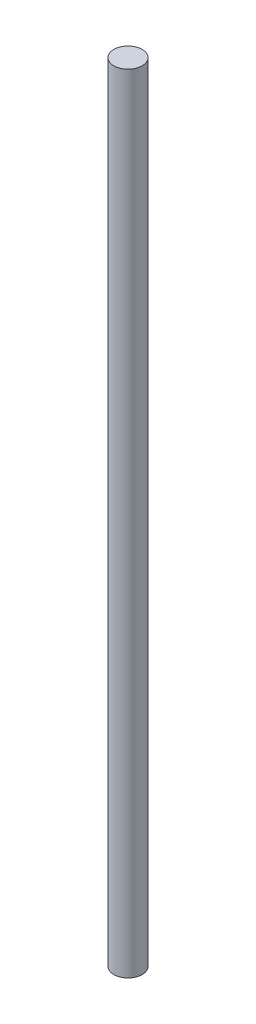
ISO-10303-21;
HEADER;
FILE_DESCRIPTION(('STEP AP214'),'2;1');
FILE_NAME('part.step','',(''),(''),'','','');
FILE_SCHEMA(('AUTOMOTIVE_DESIGN { 1 0 10303 214 1 1 1 1 }'));
ENDSEC;
DATA;
#1=APPLICATION_CONTEXT('core data for automotive mechanical design processes');
#2=APPLICATION_PROTOCOL_DEFINITION('international standard','automotive_design',2000,#1);
#3=PRODUCT_CONTEXT('',#1,'mechanical');
#4=PRODUCT('Part','Part','',(#3));
#5=PRODUCT_RELATED_PRODUCT_CATEGORY('part','',(#4));
#6=PRODUCT_DEFINITION_FORMATION('','',#4);
#7=PRODUCT_DEFINITION_CONTEXT('part definition',#1,'design');
#8=PRODUCT_DEFINITION('design','',#6,#7);
#9=PRODUCT_DEFINITION_SHAPE('','',#8);
#10=(LENGTH_UNIT() NAMED_UNIT(*) SI_UNIT(.MILLI.,.METRE.));
#11=(NAMED_UNIT(*) PLANE_ANGLE_UNIT() SI_UNIT($,.RADIAN.));
#12=(NAMED_UNIT(*) SI_UNIT($,.STERADIAN.) SOLID_ANGLE_UNIT());
#13=UNCERTAINTY_MEASURE_WITH_UNIT(LENGTH_MEASURE(1.E-05),#10,'distance_accuracy_value','');
#14=(GEOMETRIC_REPRESENTATION_CONTEXT(3) GLOBAL_UNCERTAINTY_ASSIGNED_CONTEXT((#13)) GLOBAL_UNIT_ASSIGNED_CONTEXT((#10,
#11,#12)) REPRESENTATION_CONTEXT('',''));
#15=CARTESIAN_POINT('',(0.,0.,0.));
#16=DIRECTION('',(0.,0.,1.));
#17=DIRECTION('',(1.,0.,0.));
#18=AXIS2_PLACEMENT_3D('',#15,#16,#17);
#19=CARTESIAN_POINT('',(0.,264.,0.));
#20=DIRECTION('',(0.,1.,0.));
#21=DIRECTION('',(-1.,0.,0.));
#22=AXIS2_PLACEMENT_3D('',#19,#20,#21);
#23=PLANE('',#22);
#24=CARTESIAN_POINT('',(4.7625,264.,0.));
#25=DIRECTION('',(0.,1.,0.));
#26=DIRECTION('',(-1.,0.,0.));
#27=AXIS2_PLACEMENT_3D('',#24,#25,#26);
#28=CIRCLE('',#27,4.7625);
#29=CARTESIAN_POINT('',(0.,264.,0.));
#30=VERTEX_POINT('',#29);
#31=EDGE_CURVE('E10',#30,#30,#28,.T.);
#32=ORIENTED_EDGE('',*,*,#31,.T.);
#33=EDGE_LOOP('',(#32));
#34=FACE_BOUND('',#33,.T.);
#35=ADVANCED_FACE('F37',(#34),#23,.T.);
#36=CARTESIAN_POINT('',(4.7625,264.,0.));
#37=DIRECTION('',(0.,1.,0.));
#38=DIRECTION('',(-1.,0.,0.));
#39=AXIS2_PLACEMENT_3D('',#36,#37,#38);
#40=CYLINDRICAL_SURFACE('',#39,4.76250000000002);
#41=CARTESIAN_POINT('',(4.76250000000003,0.,0.));
#42=DIRECTION('',(0.,1.,0.));
#43=DIRECTION('',(-1.,0.,0.));
#44=AXIS2_PLACEMENT_3D('',#41,#42,#43);
#45=CIRCLE('',#44,4.76250000000003);
#46=CARTESIAN_POINT('',(0.,0.,0.));
#47=VERTEX_POINT('',#46);
#48=EDGE_CURVE('E43',#47,#47,#45,.T.);
#49=ORIENTED_EDGE('',*,*,#48,.T.);
#50=EDGE_LOOP('',(#49));
#51=FACE_BOUND('',#50,.T.);
#52=ORIENTED_EDGE('',*,*,#31,.F.);
#53=EDGE_LOOP('',(#52));
#54=FACE_BOUND('',#53,.T.);
#55=ADVANCED_FACE('F49',(#51,#54),#40,.T.);
#56=CARTESIAN_POINT('',(0.,0.,0.));
#57=DIRECTION('',(0.,-1.,0.));
#58=DIRECTION('',(1.,0.,0.));
#59=AXIS2_PLACEMENT_3D('',#56,#57,#58);
#60=PLANE('',#59);
#61=ORIENTED_EDGE('',*,*,#48,.F.);
#62=EDGE_LOOP('',(#61));
#63=FACE_BOUND('',#62,.T.);
#64=ADVANCED_FACE('F52',(#63),#60,.T.);
#65=CLOSED_SHELL('',(#35,#55,#64));
#66=MANIFOLD_SOLID_BREP('B2',#65);
#67=ADVANCED_BREP_SHAPE_REPRESENTATION('',(#18,#66),#14);
#68=SHAPE_DEFINITION_REPRESENTATION(#9,#67);
ENDSEC;
END-ISO-10303-21;
